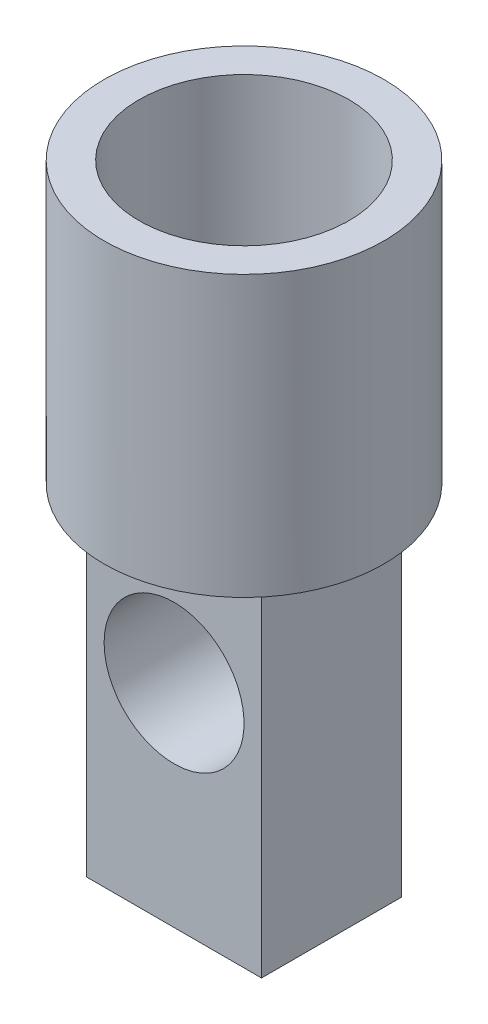
ISO-10303-21;
HEADER;
FILE_DESCRIPTION(('STEP AP214'),'2;1');
FILE_NAME('part.step','',(''),(''),'','','');
FILE_SCHEMA(('AUTOMOTIVE_DESIGN { 1 0 10303 214 1 1 1 1 }'));
ENDSEC;
DATA;
#1=APPLICATION_CONTEXT('core data for automotive mechanical design processes');
#2=APPLICATION_PROTOCOL_DEFINITION('international standard','automotive_design',2000,#1);
#3=PRODUCT_CONTEXT('',#1,'mechanical');
#4=PRODUCT('Part','Part','',(#3));
#5=PRODUCT_RELATED_PRODUCT_CATEGORY('part','',(#4));
#6=PRODUCT_DEFINITION_FORMATION('','',#4);
#7=PRODUCT_DEFINITION_CONTEXT('part definition',#1,'design');
#8=PRODUCT_DEFINITION('design','',#6,#7);
#9=PRODUCT_DEFINITION_SHAPE('','',#8);
#10=(LENGTH_UNIT() NAMED_UNIT(*) SI_UNIT(.MILLI.,.METRE.));
#11=(NAMED_UNIT(*) PLANE_ANGLE_UNIT() SI_UNIT($,.RADIAN.));
#12=(NAMED_UNIT(*) SI_UNIT($,.STERADIAN.) SOLID_ANGLE_UNIT());
#13=UNCERTAINTY_MEASURE_WITH_UNIT(LENGTH_MEASURE(1.E-05),#10,'distance_accuracy_value','');
#14=(GEOMETRIC_REPRESENTATION_CONTEXT(3) GLOBAL_UNCERTAINTY_ASSIGNED_CONTEXT((#13)) GLOBAL_UNIT_ASSIGNED_CONTEXT((#10,
#11,#12)) REPRESENTATION_CONTEXT('',''));
#15=CARTESIAN_POINT('',(0.,0.,0.));
#16=DIRECTION('',(0.,0.,1.));
#17=DIRECTION('',(1.,0.,0.));
#18=AXIS2_PLACEMENT_3D('',#15,#16,#17);
#19=CARTESIAN_POINT('',(0.,-1.,0.));
#20=DIRECTION('',(0.,1.,0.));
#21=DIRECTION('',(0.,0.,1.));
#22=AXIS2_PLACEMENT_3D('',#19,#20,#21);
#23=PLANE('',#22);
#24=CARTESIAN_POINT('',(0.,-1.,0.));
#25=DIRECTION('',(0.,1.,0.));
#26=DIRECTION('',(0.,0.,1.));
#27=AXIS2_PLACEMENT_3D('',#24,#25,#26);
#28=CIRCLE('',#27,2.);
#29=CARTESIAN_POINT('',(0.,-1.,2.));
#30=VERTEX_POINT('',#29);
#31=EDGE_CURVE('E105',#30,#30,#28,.T.);
#32=ORIENTED_EDGE('',*,*,#31,.F.);
#33=EDGE_LOOP('',(#32));
#34=FACE_BOUND('',#33,.T.);
#35=DIRECTION('',(0.,0.,1.));
#36=VECTOR('',#35,1.);
#37=CARTESIAN_POINT('',(1.25000000000001,-1.,-1.));
#38=LINE('',#37,#36);
#39=CARTESIAN_POINT('',(1.25000000000001,-1.,-1.));
#40=VERTEX_POINT('',#39);
#41=CARTESIAN_POINT('',(1.25000000000001,-1.,1.));
#42=VERTEX_POINT('',#41);
#43=EDGE_CURVE('E59',#40,#42,#38,.T.);
#44=ORIENTED_EDGE('',*,*,#43,.F.);
#45=DIRECTION('',(1.,0.,0.));
#46=VECTOR('',#45,1.);
#47=CARTESIAN_POINT('',(-1.24999999999999,-1.,-1.));
#48=LINE('',#47,#46);
#49=CARTESIAN_POINT('',(-1.24999999999999,-1.,-1.));
#50=VERTEX_POINT('',#49);
#51=EDGE_CURVE('E63',#50,#40,#48,.T.);
#52=ORIENTED_EDGE('',*,*,#51,.F.);
#53=DIRECTION('',(0.,0.,-1.));
#54=VECTOR('',#53,1.);
#55=CARTESIAN_POINT('',(-1.24999999999999,-1.,-1.));
#56=LINE('',#55,#54);
#57=CARTESIAN_POINT('',(-1.24999999999999,-1.,1.));
#58=VERTEX_POINT('',#57);
#59=EDGE_CURVE('E175',#58,#50,#56,.T.);
#60=ORIENTED_EDGE('',*,*,#59,.F.);
#61=DIRECTION('',(-1.,0.,0.));
#62=VECTOR('',#61,1.);
#63=CARTESIAN_POINT('',(-1.24999999999999,-1.,1.));
#64=LINE('',#63,#62);
#65=EDGE_CURVE('E168',#42,#58,#64,.T.);
#66=ORIENTED_EDGE('',*,*,#65,.F.);
#67=EDGE_LOOP('',(#44,#52,#60,#66));
#68=FACE_BOUND('',#67,.T.);
#69=ADVANCED_FACE('F43',(#34,#68),#23,.F.);
#70=CARTESIAN_POINT('',(0.,0.,0.));
#71=DIRECTION('',(0.,-1.,0.));
#72=DIRECTION('',(0.,0.,-1.));
#73=AXIS2_PLACEMENT_3D('',#70,#71,#72);
#74=CYLINDRICAL_SURFACE('',#73,2.);
#75=CARTESIAN_POINT('',(0.,3.,0.));
#76=DIRECTION('',(0.,-1.,0.));
#77=DIRECTION('',(0.,0.,-1.));
#78=AXIS2_PLACEMENT_3D('',#75,#76,#77);
#79=CIRCLE('',#78,2.);
#80=CARTESIAN_POINT('',(0.,3.,-2.));
#81=VERTEX_POINT('',#80);
#82=EDGE_CURVE('E11',#81,#81,#79,.T.);
#83=ORIENTED_EDGE('',*,*,#82,.T.);
#84=EDGE_LOOP('',(#83));
#85=FACE_BOUND('',#84,.T.);
#86=ORIENTED_EDGE('',*,*,#31,.T.);
#87=EDGE_LOOP('',(#86));
#88=FACE_BOUND('',#87,.T.);
#89=ADVANCED_FACE('F45',(#85,#88),#74,.T.);
#90=CARTESIAN_POINT('',(-2.,3.,0.));
#91=DIRECTION('',(0.,-1.,0.));
#92=DIRECTION('',(0.,0.,-1.));
#93=AXIS2_PLACEMENT_3D('',#90,#91,#92);
#94=PLANE('',#93);
#95=ORIENTED_EDGE('',*,*,#82,.F.);
#96=EDGE_LOOP('',(#95));
#97=FACE_BOUND('',#96,.T.);
#98=CARTESIAN_POINT('',(0.,3.,0.));
#99=DIRECTION('',(0.,-1.,0.));
#100=DIRECTION('',(0.,0.,-1.));
#101=AXIS2_PLACEMENT_3D('',#98,#99,#100);
#102=CIRCLE('',#101,1.5);
#103=CARTESIAN_POINT('',(0.,3.,-1.5));
#104=VERTEX_POINT('',#103);
#105=EDGE_CURVE('E52',#104,#104,#102,.T.);
#106=ORIENTED_EDGE('',*,*,#105,.T.);
#107=EDGE_LOOP('',(#106));
#108=FACE_BOUND('',#107,.T.);
#109=ADVANCED_FACE('F119',(#97,#108),#94,.F.);
#110=CARTESIAN_POINT('',(0.,0.,0.));
#111=DIRECTION('',(0.,-1.,0.));
#112=DIRECTION('',(0.,0.,-1.));
#113=AXIS2_PLACEMENT_3D('',#110,#111,#112);
#114=CYLINDRICAL_SURFACE('',#113,1.5);
#115=ORIENTED_EDGE('',*,*,#105,.F.);
#116=EDGE_LOOP('',(#115));
#117=FACE_BOUND('',#116,.T.);
#118=CARTESIAN_POINT('',(0.,0.,0.));
#119=DIRECTION('',(0.,-1.,0.));
#120=DIRECTION('',(0.,0.,-1.));
#121=AXIS2_PLACEMENT_3D('',#118,#119,#120);
#122=CIRCLE('',#121,1.5);
#123=CARTESIAN_POINT('',(0.,0.,-1.5));
#124=VERTEX_POINT('',#123);
#125=EDGE_CURVE('E108',#124,#124,#122,.T.);
#126=ORIENTED_EDGE('',*,*,#125,.T.);
#127=EDGE_LOOP('',(#126));
#128=FACE_BOUND('',#127,.T.);
#129=ADVANCED_FACE('F121',(#117,#128),#114,.F.);
#130=CARTESIAN_POINT('',(0.,0.,0.));
#131=DIRECTION('',(0.,1.,0.));
#132=DIRECTION('',(0.,0.,1.));
#133=AXIS2_PLACEMENT_3D('',#130,#131,#132);
#134=PLANE('',#133);
#135=ORIENTED_EDGE('',*,*,#125,.F.);
#136=EDGE_LOOP('',(#135));
#137=FACE_BOUND('',#136,.T.);
#138=ADVANCED_FACE('F124',(#137),#134,.T.);
#139=CARTESIAN_POINT('',(1.25000000000001,-6.,-1.));
#140=DIRECTION('',(-1.,0.,0.));
#141=DIRECTION('',(0.,0.,1.));
#142=AXIS2_PLACEMENT_3D('',#139,#140,#141);
#143=PLANE('',#142);
#144=ORIENTED_EDGE('',*,*,#43,.T.);
#145=DIRECTION('',(0.,1.,0.));
#146=VECTOR('',#145,1.);
#147=CARTESIAN_POINT('',(1.25000000000001,-6.,1.));
#148=LINE('',#147,#146);
#149=CARTESIAN_POINT('',(1.25000000000001,-6.,1.));
#150=VERTEX_POINT('',#149);
#151=EDGE_CURVE('E88',#150,#42,#148,.T.);
#152=ORIENTED_EDGE('',*,*,#151,.F.);
#153=DIRECTION('',(0.,0.,1.));
#154=VECTOR('',#153,1.);
#155=CARTESIAN_POINT('',(1.25000000000001,-6.,-1.));
#156=LINE('',#155,#154);
#157=CARTESIAN_POINT('',(1.25000000000001,-6.,-1.));
#158=VERTEX_POINT('',#157);
#159=EDGE_CURVE('E94',#158,#150,#156,.T.);
#160=ORIENTED_EDGE('',*,*,#159,.F.);
#161=DIRECTION('',(0.,1.,0.));
#162=VECTOR('',#161,1.);
#163=CARTESIAN_POINT('',(1.25000000000001,-6.,-1.));
#164=LINE('',#163,#162);
#165=EDGE_CURVE('E172',#158,#40,#164,.T.);
#166=ORIENTED_EDGE('',*,*,#165,.T.);
#167=EDGE_LOOP('',(#144,#152,#160,#166));
#168=FACE_BOUND('',#167,.T.);
#169=ADVANCED_FACE('F104',(#168),#143,.F.);
#170=CARTESIAN_POINT('',(-1.24999999999999,-6.,1.));
#171=DIRECTION('',(0.,0.,-1.));
#172=DIRECTION('',(-1.,0.,0.));
#173=AXIS2_PLACEMENT_3D('',#170,#171,#172);
#174=PLANE('',#173);
#175=CARTESIAN_POINT('',(0.,-2.97308461095047,1.));
#176=DIRECTION('',(0.,0.,-1.));
#177=DIRECTION('',(-1.,0.,0.));
#178=AXIS2_PLACEMENT_3D('',#175,#176,#177);
#179=CIRCLE('',#178,1.);
#180=CARTESIAN_POINT('',(-1.,-2.97308461095047,1.));
#181=VERTEX_POINT('',#180);
#182=EDGE_CURVE('E166',#181,#181,#179,.T.);
#183=ORIENTED_EDGE('',*,*,#182,.T.);
#184=EDGE_LOOP('',(#183));
#185=FACE_BOUND('',#184,.T.);
#186=ORIENTED_EDGE('',*,*,#65,.T.);
#187=DIRECTION('',(0.,1.,0.));
#188=VECTOR('',#187,1.);
#189=CARTESIAN_POINT('',(-1.24999999999999,-6.,1.));
#190=LINE('',#189,#188);
#191=CARTESIAN_POINT('',(-1.24999999999999,-6.,1.));
#192=VERTEX_POINT('',#191);
#193=EDGE_CURVE('E90',#192,#58,#190,.T.);
#194=ORIENTED_EDGE('',*,*,#193,.F.);
#195=DIRECTION('',(-1.,0.,0.));
#196=VECTOR('',#195,1.);
#197=CARTESIAN_POINT('',(-1.24999999999999,-6.,1.));
#198=LINE('',#197,#196);
#199=EDGE_CURVE('E83',#150,#192,#198,.T.);
#200=ORIENTED_EDGE('',*,*,#199,.F.);
#201=ORIENTED_EDGE('',*,*,#151,.T.);
#202=EDGE_LOOP('',(#186,#194,#200,#201));
#203=FACE_BOUND('',#202,.T.);
#204=ADVANCED_FACE('F86',(#185,#203),#174,.F.);
#205=CARTESIAN_POINT('',(-1.24999999999999,-6.,-1.));
#206=DIRECTION('',(1.,0.,0.));
#207=DIRECTION('',(0.,0.,-1.));
#208=AXIS2_PLACEMENT_3D('',#205,#206,#207);
#209=PLANE('',#208);
#210=ORIENTED_EDGE('',*,*,#59,.T.);
#211=DIRECTION('',(0.,1.,0.));
#212=VECTOR('',#211,1.);
#213=CARTESIAN_POINT('',(-1.24999999999999,-6.,-1.));
#214=LINE('',#213,#212);
#215=CARTESIAN_POINT('',(-1.24999999999999,-6.,-1.));
#216=VERTEX_POINT('',#215);
#217=EDGE_CURVE('E110',#216,#50,#214,.T.);
#218=ORIENTED_EDGE('',*,*,#217,.F.);
#219=DIRECTION('',(0.,0.,-1.));
#220=VECTOR('',#219,1.);
#221=CARTESIAN_POINT('',(-1.24999999999999,-6.,-1.));
#222=LINE('',#221,#220);
#223=EDGE_CURVE('E93',#192,#216,#222,.T.);
#224=ORIENTED_EDGE('',*,*,#223,.F.);
#225=ORIENTED_EDGE('',*,*,#193,.T.);
#226=EDGE_LOOP('',(#210,#218,#224,#225));
#227=FACE_BOUND('',#226,.T.);
#228=ADVANCED_FACE('F145',(#227),#209,.F.);
#229=CARTESIAN_POINT('',(-1.24999999999999,-6.,-1.));
#230=DIRECTION('',(0.,0.,1.));
#231=DIRECTION('',(1.,0.,0.));
#232=AXIS2_PLACEMENT_3D('',#229,#230,#231);
#233=PLANE('',#232);
#234=CARTESIAN_POINT('',(0.,-2.97308461095047,-1.));
#235=DIRECTION('',(0.,0.,1.));
#236=DIRECTION('',(1.,0.,0.));
#237=AXIS2_PLACEMENT_3D('',#234,#235,#236);
#238=CIRCLE('',#237,1.);
#239=CARTESIAN_POINT('',(1.,-2.97308461095047,-1.));
#240=VERTEX_POINT('',#239);
#241=EDGE_CURVE('E47',#240,#240,#238,.T.);
#242=ORIENTED_EDGE('',*,*,#241,.T.);
#243=EDGE_LOOP('',(#242));
#244=FACE_BOUND('',#243,.T.);
#245=ORIENTED_EDGE('',*,*,#51,.T.);
#246=ORIENTED_EDGE('',*,*,#165,.F.);
#247=DIRECTION('',(1.,0.,0.));
#248=VECTOR('',#247,1.);
#249=CARTESIAN_POINT('',(-1.24999999999999,-6.,-1.));
#250=LINE('',#249,#248);
#251=EDGE_CURVE('E99',#216,#158,#250,.T.);
#252=ORIENTED_EDGE('',*,*,#251,.F.);
#253=ORIENTED_EDGE('',*,*,#217,.T.);
#254=EDGE_LOOP('',(#245,#246,#252,#253));
#255=FACE_BOUND('',#254,.T.);
#256=ADVANCED_FACE('F149',(#244,#255),#233,.F.);
#257=CARTESIAN_POINT('',(0.,-6.,0.));
#258=DIRECTION('',(0.,1.,0.));
#259=DIRECTION('',(0.,0.,1.));
#260=AXIS2_PLACEMENT_3D('',#257,#258,#259);
#261=PLANE('',#260);
#262=ORIENTED_EDGE('',*,*,#159,.T.);
#263=ORIENTED_EDGE('',*,*,#199,.T.);
#264=ORIENTED_EDGE('',*,*,#223,.T.);
#265=ORIENTED_EDGE('',*,*,#251,.T.);
#266=EDGE_LOOP('',(#262,#263,#264,#265));
#267=FACE_BOUND('',#266,.T.);
#268=ADVANCED_FACE('F97',(#267),#261,.F.);
#269=CARTESIAN_POINT('',(0.,-2.97308461095047,2.));
#270=DIRECTION('',(0.,0.,-1.));
#271=DIRECTION('',(-1.,0.,0.));
#272=AXIS2_PLACEMENT_3D('',#269,#270,#271);
#273=CYLINDRICAL_SURFACE('',#272,1.);
#274=ORIENTED_EDGE('',*,*,#241,.F.);
#275=EDGE_LOOP('',(#274));
#276=FACE_BOUND('',#275,.T.);
#277=ORIENTED_EDGE('',*,*,#182,.F.);
#278=EDGE_LOOP('',(#277));
#279=FACE_BOUND('',#278,.T.);
#280=ADVANCED_FACE('F156',(#276,#279),#273,.F.);
#281=CLOSED_SHELL('',(#69,#89,#109,#129,#138,#169,#204,#228,#256,#268,#280));
#282=MANIFOLD_SOLID_BREP('B2',#281);
#283=ADVANCED_BREP_SHAPE_REPRESENTATION('',(#18,#282),#14);
#284=SHAPE_DEFINITION_REPRESENTATION(#9,#283);
ENDSEC;
END-ISO-10303-21;
